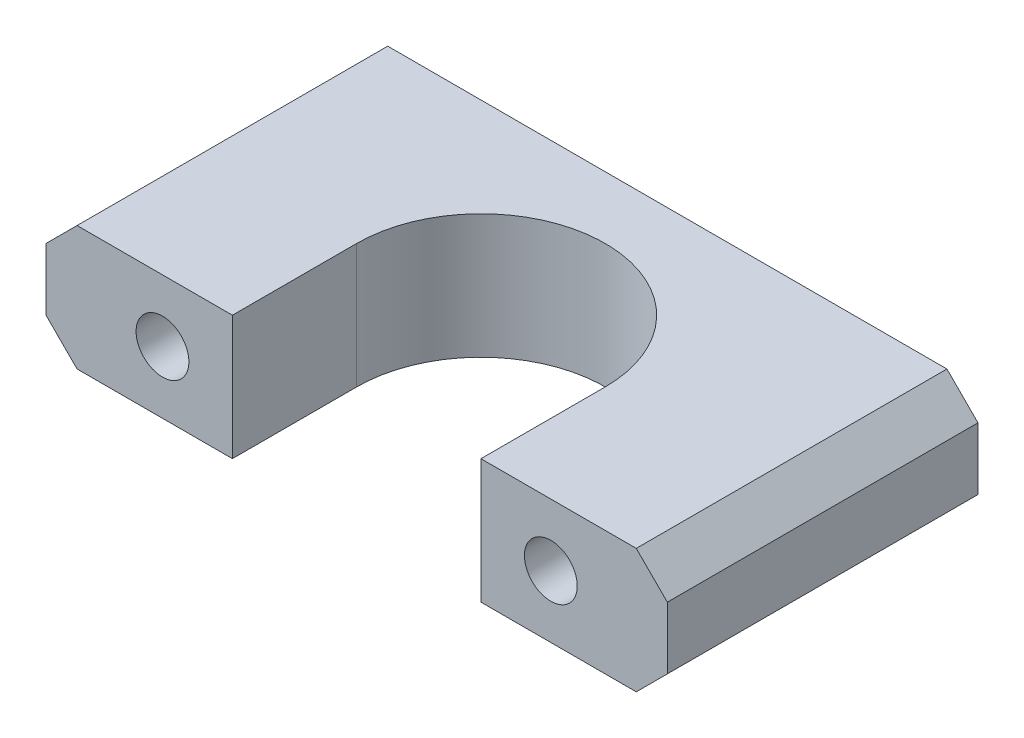
ISO-10303-21;
HEADER;
FILE_DESCRIPTION(('STEP AP214'),'2;1');
FILE_NAME('part.step','',(''),(''),'','','');
FILE_SCHEMA(('AUTOMOTIVE_DESIGN { 1 0 10303 214 1 1 1 1 }'));
ENDSEC;
DATA;
#1=APPLICATION_CONTEXT('core data for automotive mechanical design processes');
#2=APPLICATION_PROTOCOL_DEFINITION('international standard','automotive_design',2000,#1);
#3=PRODUCT_CONTEXT('',#1,'mechanical');
#4=PRODUCT('Part','Part','',(#3));
#5=PRODUCT_RELATED_PRODUCT_CATEGORY('part','',(#4));
#6=PRODUCT_DEFINITION_FORMATION('','',#4);
#7=PRODUCT_DEFINITION_CONTEXT('part definition',#1,'design');
#8=PRODUCT_DEFINITION('design','',#6,#7);
#9=PRODUCT_DEFINITION_SHAPE('','',#8);
#10=(LENGTH_UNIT() NAMED_UNIT(*) SI_UNIT(.MILLI.,.METRE.));
#11=(NAMED_UNIT(*) PLANE_ANGLE_UNIT() SI_UNIT($,.RADIAN.));
#12=(NAMED_UNIT(*) SI_UNIT($,.STERADIAN.) SOLID_ANGLE_UNIT());
#13=UNCERTAINTY_MEASURE_WITH_UNIT(LENGTH_MEASURE(1.E-05),#10,'distance_accuracy_value','');
#14=(GEOMETRIC_REPRESENTATION_CONTEXT(3) GLOBAL_UNCERTAINTY_ASSIGNED_CONTEXT((#13)) GLOBAL_UNIT_ASSIGNED_CONTEXT((#10,
#11,#12)) REPRESENTATION_CONTEXT('',''));
#15=CARTESIAN_POINT('',(0.,0.,0.));
#16=DIRECTION('',(0.,0.,1.));
#17=DIRECTION('',(1.,0.,0.));
#18=AXIS2_PLACEMENT_3D('',#15,#16,#17);
#19=CARTESIAN_POINT('',(0.,8.,0.));
#20=DIRECTION('',(0.,0.,-1.));
#21=DIRECTION('',(-1.,0.,0.));
#22=AXIS2_PLACEMENT_3D('',#19,#20,#21);
#23=PLANE('',#22);
#24=CARTESIAN_POINT('',(7.5,4.,0.));
#25=DIRECTION('',(0.,0.,1.));
#26=DIRECTION('',(1.,0.,0.));
#27=AXIS2_PLACEMENT_3D('',#24,#25,#26);
#28=CIRCLE('',#27,1.7);
#29=CARTESIAN_POINT('',(9.2,4.,0.));
#30=VERTEX_POINT('',#29);
#31=EDGE_CURVE('E150',#30,#30,#28,.T.);
#32=ORIENTED_EDGE('',*,*,#31,.F.);
#33=EDGE_LOOP('',(#32));
#34=FACE_BOUND('',#33,.T.);
#35=DIRECTION('',(1.,0.,0.));
#36=VECTOR('',#35,1.);
#37=CARTESIAN_POINT('',(0.,8.,0.));
#38=LINE('',#37,#36);
#39=CARTESIAN_POINT('',(2.,8.,0.));
#40=VERTEX_POINT('',#39);
#41=CARTESIAN_POINT('',(12.,8.,0.));
#42=VERTEX_POINT('',#41);
#43=EDGE_CURVE('E164',#40,#42,#38,.T.);
#44=ORIENTED_EDGE('',*,*,#43,.F.);
#45=DIRECTION('',(0.707106781186546,0.707106781186549,0.));
#46=VECTOR('',#45,1.);
#47=CARTESIAN_POINT('',(2.,8.,0.));
#48=LINE('',#47,#46);
#49=CARTESIAN_POINT('',(0.,5.99999999999999,0.));
#50=VERTEX_POINT('',#49);
#51=EDGE_CURVE('E54',#40,#50,#48,.F.);
#52=ORIENTED_EDGE('',*,*,#51,.T.);
#53=DIRECTION('',(0.,-1.,0.));
#54=VECTOR('',#53,1.);
#55=CARTESIAN_POINT('',(0.,8.,0.));
#56=LINE('',#55,#54);
#57=CARTESIAN_POINT('',(0.,2.,0.));
#58=VERTEX_POINT('',#57);
#59=EDGE_CURVE('E184',#50,#58,#56,.T.);
#60=ORIENTED_EDGE('',*,*,#59,.T.);
#61=DIRECTION('',(0.707106781186549,-0.707106781186546,0.));
#62=VECTOR('',#61,1.);
#63=CARTESIAN_POINT('',(0.,2.,0.));
#64=LINE('',#63,#62);
#65=CARTESIAN_POINT('',(2.00000000000001,0.,0.));
#66=VERTEX_POINT('',#65);
#67=EDGE_CURVE('E46',#58,#66,#64,.T.);
#68=ORIENTED_EDGE('',*,*,#67,.T.);
#69=DIRECTION('',(1.,0.,0.));
#70=VECTOR('',#69,1.);
#71=CARTESIAN_POINT('',(0.,0.,0.));
#72=LINE('',#71,#70);
#73=CARTESIAN_POINT('',(12.,0.,0.));
#74=VERTEX_POINT('',#73);
#75=EDGE_CURVE('E171',#66,#74,#72,.T.);
#76=ORIENTED_EDGE('',*,*,#75,.T.);
#77=DIRECTION('',(0.,-1.,0.));
#78=VECTOR('',#77,1.);
#79=CARTESIAN_POINT('',(12.,8.,0.));
#80=LINE('',#79,#78);
#81=EDGE_CURVE('E160',#42,#74,#80,.T.);
#82=ORIENTED_EDGE('',*,*,#81,.F.);
#83=EDGE_LOOP('',(#44,#52,#60,#68,#76,#82));
#84=FACE_BOUND('',#83,.T.);
#85=ADVANCED_FACE('F31',(#34,#84),#23,.F.);
#86=CARTESIAN_POINT('',(0.,8.,0.));
#87=DIRECTION('',(1.,0.,0.));
#88=DIRECTION('',(0.,0.,-1.));
#89=AXIS2_PLACEMENT_3D('',#86,#87,#88);
#90=PLANE('',#89);
#91=ORIENTED_EDGE('',*,*,#59,.F.);
#92=DIRECTION('',(0.,0.,-1.));
#93=VECTOR('',#92,1.);
#94=CARTESIAN_POINT('',(0.,5.99999999999999,0.));
#95=LINE('',#94,#93);
#96=CARTESIAN_POINT('',(0.,5.99999999999999,-20.));
#97=VERTEX_POINT('',#96);
#98=EDGE_CURVE('E11',#50,#97,#95,.T.);
#99=ORIENTED_EDGE('',*,*,#98,.T.);
#100=DIRECTION('',(0.,-1.,0.));
#101=VECTOR('',#100,1.);
#102=CARTESIAN_POINT('',(0.,8.,-20.));
#103=LINE('',#102,#101);
#104=CARTESIAN_POINT('',(0.,2.,-20.));
#105=VERTEX_POINT('',#104);
#106=EDGE_CURVE('E170',#97,#105,#103,.T.);
#107=ORIENTED_EDGE('',*,*,#106,.T.);
#108=DIRECTION('',(0.,0.,1.));
#109=VECTOR('',#108,1.);
#110=CARTESIAN_POINT('',(0.,2.,0.));
#111=LINE('',#110,#109);
#112=EDGE_CURVE('E39',#105,#58,#111,.T.);
#113=ORIENTED_EDGE('',*,*,#112,.T.);
#114=EDGE_LOOP('',(#91,#99,#107,#113));
#115=FACE_BOUND('',#114,.T.);
#116=ADVANCED_FACE('F215',(#115),#90,.F.);
#117=CARTESIAN_POINT('',(32.5,4.,0.));
#118=DIRECTION('',(0.,0.,1.));
#119=DIRECTION('',(-1.,0.,0.));
#120=AXIS2_PLACEMENT_3D('',#117,#118,#119);
#121=CIRCLE('',#120,1.7);
#122=CARTESIAN_POINT('',(30.8,4.,0.));
#123=VERTEX_POINT('',#122);
#124=EDGE_CURVE('E279',#123,#123,#121,.T.);
#125=ORIENTED_EDGE('',*,*,#124,.F.);
#126=EDGE_LOOP('',(#125));
#127=FACE_BOUND('',#126,.T.);
#128=DIRECTION('',(0.,-1.,0.));
#129=VECTOR('',#128,1.);
#130=CARTESIAN_POINT('',(40.,8.,0.));
#131=LINE('',#130,#129);
#132=CARTESIAN_POINT('',(40.,5.99999999999998,0.));
#133=VERTEX_POINT('',#132);
#134=CARTESIAN_POINT('',(40.,2.,0.));
#135=VERTEX_POINT('',#134);
#136=EDGE_CURVE('E181',#133,#135,#131,.T.);
#137=ORIENTED_EDGE('',*,*,#136,.F.);
#138=DIRECTION('',(0.707106781186546,-0.707106781186549,0.));
#139=VECTOR('',#138,1.);
#140=CARTESIAN_POINT('',(38.,8.,0.));
#141=LINE('',#140,#139);
#142=CARTESIAN_POINT('',(38.,8.,0.));
#143=VERTEX_POINT('',#142);
#144=EDGE_CURVE('E207',#133,#143,#141,.F.);
#145=ORIENTED_EDGE('',*,*,#144,.T.);
#146=CARTESIAN_POINT('',(28.,8.,0.));
#147=VERTEX_POINT('',#146);
#148=EDGE_CURVE('E167',#147,#143,#38,.T.);
#149=ORIENTED_EDGE('',*,*,#148,.F.);
#150=DIRECTION('',(0.,-1.,0.));
#151=VECTOR('',#150,1.);
#152=CARTESIAN_POINT('',(28.,8.,0.));
#153=LINE('',#152,#151);
#154=CARTESIAN_POINT('',(28.,0.,0.));
#155=VERTEX_POINT('',#154);
#156=EDGE_CURVE('E131',#147,#155,#153,.T.);
#157=ORIENTED_EDGE('',*,*,#156,.T.);
#158=CARTESIAN_POINT('',(38.,0.,0.));
#159=VERTEX_POINT('',#158);
#160=EDGE_CURVE('E159',#155,#159,#72,.T.);
#161=ORIENTED_EDGE('',*,*,#160,.T.);
#162=DIRECTION('',(0.707106781186549,0.707106781186546,0.));
#163=VECTOR('',#162,1.);
#164=CARTESIAN_POINT('',(40.,2.,0.));
#165=LINE('',#164,#163);
#166=EDGE_CURVE('E205',#159,#135,#165,.T.);
#167=ORIENTED_EDGE('',*,*,#166,.T.);
#168=EDGE_LOOP('',(#137,#145,#149,#157,#161,#167));
#169=FACE_BOUND('',#168,.T.);
#170=ADVANCED_FACE('F238',(#127,#169),#23,.F.);
#171=CARTESIAN_POINT('',(40.,8.,0.));
#172=DIRECTION('',(-1.,0.,0.));
#173=DIRECTION('',(0.,0.,1.));
#174=AXIS2_PLACEMENT_3D('',#171,#172,#173);
#175=PLANE('',#174);
#176=DIRECTION('',(0.,-1.,0.));
#177=VECTOR('',#176,1.);
#178=CARTESIAN_POINT('',(40.,8.,-20.));
#179=LINE('',#178,#177);
#180=CARTESIAN_POINT('',(40.,5.99999999999998,-20.));
#181=VERTEX_POINT('',#180);
#182=CARTESIAN_POINT('',(40.,2.,-20.));
#183=VERTEX_POINT('',#182);
#184=EDGE_CURVE('E178',#181,#183,#179,.T.);
#185=ORIENTED_EDGE('',*,*,#184,.F.);
#186=DIRECTION('',(0.,0.,1.));
#187=VECTOR('',#186,1.);
#188=CARTESIAN_POINT('',(40.,5.99999999999998,0.));
#189=LINE('',#188,#187);
#190=EDGE_CURVE('E203',#181,#133,#189,.T.);
#191=ORIENTED_EDGE('',*,*,#190,.T.);
#192=ORIENTED_EDGE('',*,*,#136,.T.);
#193=DIRECTION('',(0.,0.,-1.));
#194=VECTOR('',#193,1.);
#195=CARTESIAN_POINT('',(40.,2.,-20.));
#196=LINE('',#195,#194);
#197=EDGE_CURVE('E200',#135,#183,#196,.T.);
#198=ORIENTED_EDGE('',*,*,#197,.T.);
#199=EDGE_LOOP('',(#185,#191,#192,#198));
#200=FACE_BOUND('',#199,.T.);
#201=ADVANCED_FACE('F242',(#200),#175,.F.);
#202=CARTESIAN_POINT('',(0.,8.,-20.));
#203=DIRECTION('',(0.,0.,1.));
#204=DIRECTION('',(1.,0.,0.));
#205=AXIS2_PLACEMENT_3D('',#202,#203,#204);
#206=PLANE('',#205);
#207=CARTESIAN_POINT('',(32.5,4.,-20.));
#208=DIRECTION('',(0.,0.,1.));
#209=DIRECTION('',(-1.,0.,0.));
#210=AXIS2_PLACEMENT_3D('',#207,#208,#209);
#211=CIRCLE('',#210,1.7);
#212=CARTESIAN_POINT('',(30.8,4.,-20.));
#213=VERTEX_POINT('',#212);
#214=EDGE_CURVE('E281',#213,#213,#211,.T.);
#215=ORIENTED_EDGE('',*,*,#214,.T.);
#216=EDGE_LOOP('',(#215));
#217=FACE_BOUND('',#216,.T.);
#218=CARTESIAN_POINT('',(7.5,4.,-20.));
#219=DIRECTION('',(0.,0.,1.));
#220=DIRECTION('',(1.,0.,0.));
#221=AXIS2_PLACEMENT_3D('',#218,#219,#220);
#222=CIRCLE('',#221,1.7);
#223=CARTESIAN_POINT('',(9.2,4.,-20.));
#224=VERTEX_POINT('',#223);
#225=EDGE_CURVE('E155',#224,#224,#222,.T.);
#226=ORIENTED_EDGE('',*,*,#225,.T.);
#227=EDGE_LOOP('',(#226));
#228=FACE_BOUND('',#227,.T.);
#229=DIRECTION('',(-1.,0.,0.));
#230=VECTOR('',#229,1.);
#231=CARTESIAN_POINT('',(0.,8.,-20.));
#232=LINE('',#231,#230);
#233=CARTESIAN_POINT('',(38.,8.,-20.));
#234=VERTEX_POINT('',#233);
#235=CARTESIAN_POINT('',(2.,8.,-20.));
#236=VERTEX_POINT('',#235);
#237=EDGE_CURVE('E166',#234,#236,#232,.T.);
#238=ORIENTED_EDGE('',*,*,#237,.F.);
#239=DIRECTION('',(-0.707106781186546,0.707106781186549,0.));
#240=VECTOR('',#239,1.);
#241=CARTESIAN_POINT('',(38.,8.,-20.));
#242=LINE('',#241,#240);
#243=EDGE_CURVE('E198',#234,#181,#242,.F.);
#244=ORIENTED_EDGE('',*,*,#243,.T.);
#245=ORIENTED_EDGE('',*,*,#184,.T.);
#246=DIRECTION('',(-0.707106781186549,-0.707106781186546,0.));
#247=VECTOR('',#246,1.);
#248=CARTESIAN_POINT('',(40.,2.,-20.));
#249=LINE('',#248,#247);
#250=CARTESIAN_POINT('',(38.,0.,-20.));
#251=VERTEX_POINT('',#250);
#252=EDGE_CURVE('E196',#183,#251,#249,.T.);
#253=ORIENTED_EDGE('',*,*,#252,.T.);
#254=DIRECTION('',(-1.,0.,0.));
#255=VECTOR('',#254,1.);
#256=CARTESIAN_POINT('',(0.,0.,-20.));
#257=LINE('',#256,#255);
#258=CARTESIAN_POINT('',(2.00000000000001,0.,-20.));
#259=VERTEX_POINT('',#258);
#260=EDGE_CURVE('E173',#251,#259,#257,.T.);
#261=ORIENTED_EDGE('',*,*,#260,.T.);
#262=DIRECTION('',(-0.707106781186549,0.707106781186546,0.));
#263=VECTOR('',#262,1.);
#264=CARTESIAN_POINT('',(0.,2.,-20.));
#265=LINE('',#264,#263);
#266=EDGE_CURVE('E192',#259,#105,#265,.T.);
#267=ORIENTED_EDGE('',*,*,#266,.T.);
#268=ORIENTED_EDGE('',*,*,#106,.F.);
#269=DIRECTION('',(-0.707106781186546,-0.707106781186549,0.));
#270=VECTOR('',#269,1.);
#271=CARTESIAN_POINT('',(2.,8.,-20.));
#272=LINE('',#271,#270);
#273=EDGE_CURVE('E194',#97,#236,#272,.F.);
#274=ORIENTED_EDGE('',*,*,#273,.T.);
#275=EDGE_LOOP('',(#238,#244,#245,#253,#261,#267,#268,#274));
#276=FACE_BOUND('',#275,.T.);
#277=ADVANCED_FACE('F227',(#217,#228,#276),#206,.F.);
#278=CARTESIAN_POINT('',(0.,8.,-20.));
#279=DIRECTION('',(0.,-1.,0.));
#280=DIRECTION('',(0.,0.,-1.));
#281=AXIS2_PLACEMENT_3D('',#278,#279,#280);
#282=PLANE('',#281);
#283=ORIENTED_EDGE('',*,*,#148,.T.);
#284=DIRECTION('',(0.,0.,-1.));
#285=VECTOR('',#284,1.);
#286=CARTESIAN_POINT('',(38.,8.,-20.));
#287=LINE('',#286,#285);
#288=EDGE_CURVE('E189',#143,#234,#287,.T.);
#289=ORIENTED_EDGE('',*,*,#288,.T.);
#290=ORIENTED_EDGE('',*,*,#237,.T.);
#291=DIRECTION('',(0.,0.,1.));
#292=VECTOR('',#291,1.);
#293=CARTESIAN_POINT('',(2.,8.,-20.));
#294=LINE('',#293,#292);
#295=EDGE_CURVE('E186',#236,#40,#294,.T.);
#296=ORIENTED_EDGE('',*,*,#295,.T.);
#297=ORIENTED_EDGE('',*,*,#43,.T.);
#298=DIRECTION('',(0.,0.,-1.));
#299=VECTOR('',#298,1.);
#300=CARTESIAN_POINT('',(12.,8.,-8.));
#301=LINE('',#300,#299);
#302=CARTESIAN_POINT('',(12.,8.,-8.));
#303=VERTEX_POINT('',#302);
#304=EDGE_CURVE('E132',#42,#303,#301,.T.);
#305=ORIENTED_EDGE('',*,*,#304,.T.);
#306=CARTESIAN_POINT('',(20.,8.,-8.));
#307=DIRECTION('',(0.,-1.,0.));
#308=DIRECTION('',(0.,0.,-1.));
#309=AXIS2_PLACEMENT_3D('',#306,#307,#308);
#310=CIRCLE('',#309,8.);
#311=CARTESIAN_POINT('',(28.,8.,-8.));
#312=VERTEX_POINT('',#311);
#313=EDGE_CURVE('E125',#303,#312,#310,.T.);
#314=ORIENTED_EDGE('',*,*,#313,.T.);
#315=DIRECTION('',(0.,0.,1.));
#316=VECTOR('',#315,1.);
#317=CARTESIAN_POINT('',(28.,8.,0.));
#318=LINE('',#317,#316);
#319=EDGE_CURVE('E135',#312,#147,#318,.T.);
#320=ORIENTED_EDGE('',*,*,#319,.T.);
#321=EDGE_LOOP('',(#283,#289,#290,#296,#297,#305,#314,#320));
#322=FACE_BOUND('',#321,.T.);
#323=ADVANCED_FACE('F142',(#322),#282,.F.);
#324=CARTESIAN_POINT('',(0.,0.,-20.));
#325=DIRECTION('',(0.,-1.,0.));
#326=DIRECTION('',(0.,0.,-1.));
#327=AXIS2_PLACEMENT_3D('',#324,#325,#326);
#328=PLANE('',#327);
#329=ORIENTED_EDGE('',*,*,#260,.F.);
#330=DIRECTION('',(0.,0.,1.));
#331=VECTOR('',#330,1.);
#332=CARTESIAN_POINT('',(38.,0.,0.));
#333=LINE('',#332,#331);
#334=EDGE_CURVE('E211',#251,#159,#333,.T.);
#335=ORIENTED_EDGE('',*,*,#334,.T.);
#336=ORIENTED_EDGE('',*,*,#160,.F.);
#337=DIRECTION('',(0.,0.,1.));
#338=VECTOR('',#337,1.);
#339=CARTESIAN_POINT('',(28.,0.,0.));
#340=LINE('',#339,#338);
#341=CARTESIAN_POINT('',(28.,0.,-8.));
#342=VERTEX_POINT('',#341);
#343=EDGE_CURVE('E147',#342,#155,#340,.T.);
#344=ORIENTED_EDGE('',*,*,#343,.F.);
#345=CARTESIAN_POINT('',(20.,0.,-8.));
#346=DIRECTION('',(0.,-1.,0.));
#347=DIRECTION('',(0.,0.,-1.));
#348=AXIS2_PLACEMENT_3D('',#345,#346,#347);
#349=CIRCLE('',#348,8.);
#350=CARTESIAN_POINT('',(12.,0.,-8.));
#351=VERTEX_POINT('',#350);
#352=EDGE_CURVE('E128',#351,#342,#349,.T.);
#353=ORIENTED_EDGE('',*,*,#352,.F.);
#354=DIRECTION('',(0.,0.,-1.));
#355=VECTOR('',#354,1.);
#356=CARTESIAN_POINT('',(12.,0.,-8.));
#357=LINE('',#356,#355);
#358=EDGE_CURVE('E144',#74,#351,#357,.T.);
#359=ORIENTED_EDGE('',*,*,#358,.F.);
#360=ORIENTED_EDGE('',*,*,#75,.F.);
#361=DIRECTION('',(0.,0.,-1.));
#362=VECTOR('',#361,1.);
#363=CARTESIAN_POINT('',(2.00000000000001,0.,-20.));
#364=LINE('',#363,#362);
#365=EDGE_CURVE('E209',#66,#259,#364,.T.);
#366=ORIENTED_EDGE('',*,*,#365,.T.);
#367=EDGE_LOOP('',(#329,#335,#336,#344,#353,#359,#360,#366));
#368=FACE_BOUND('',#367,.T.);
#369=ADVANCED_FACE('F224',(#368),#328,.T.);
#370=CARTESIAN_POINT('',(20.,8.,-8.));
#371=DIRECTION('',(0.,-1.,0.));
#372=DIRECTION('',(0.,0.,-1.));
#373=AXIS2_PLACEMENT_3D('',#370,#371,#372);
#374=CYLINDRICAL_SURFACE('',#373,8.);
#375=ORIENTED_EDGE('',*,*,#352,.T.);
#376=DIRECTION('',(0.,-1.,0.));
#377=VECTOR('',#376,1.);
#378=CARTESIAN_POINT('',(28.,8.,-8.));
#379=LINE('',#378,#377);
#380=EDGE_CURVE('E121',#312,#342,#379,.T.);
#381=ORIENTED_EDGE('',*,*,#380,.F.);
#382=ORIENTED_EDGE('',*,*,#313,.F.);
#383=DIRECTION('',(0.,-1.,0.));
#384=VECTOR('',#383,1.);
#385=CARTESIAN_POINT('',(12.,8.,-8.));
#386=LINE('',#385,#384);
#387=EDGE_CURVE('E157',#303,#351,#386,.T.);
#388=ORIENTED_EDGE('',*,*,#387,.T.);
#389=EDGE_LOOP('',(#375,#381,#382,#388));
#390=FACE_BOUND('',#389,.T.);
#391=ADVANCED_FACE('F123',(#390),#374,.F.);
#392=CARTESIAN_POINT('',(12.,8.,-8.));
#393=DIRECTION('',(-1.,0.,0.));
#394=DIRECTION('',(0.,0.,1.));
#395=AXIS2_PLACEMENT_3D('',#392,#393,#394);
#396=PLANE('',#395);
#397=ORIENTED_EDGE('',*,*,#358,.T.);
#398=ORIENTED_EDGE('',*,*,#387,.F.);
#399=ORIENTED_EDGE('',*,*,#304,.F.);
#400=ORIENTED_EDGE('',*,*,#81,.T.);
#401=EDGE_LOOP('',(#397,#398,#399,#400));
#402=FACE_BOUND('',#401,.T.);
#403=ADVANCED_FACE('F251',(#402),#396,.F.);
#404=CARTESIAN_POINT('',(28.,8.,0.));
#405=DIRECTION('',(1.,0.,0.));
#406=DIRECTION('',(0.,0.,-1.));
#407=AXIS2_PLACEMENT_3D('',#404,#405,#406);
#408=PLANE('',#407);
#409=ORIENTED_EDGE('',*,*,#343,.T.);
#410=ORIENTED_EDGE('',*,*,#156,.F.);
#411=ORIENTED_EDGE('',*,*,#319,.F.);
#412=ORIENTED_EDGE('',*,*,#380,.T.);
#413=EDGE_LOOP('',(#409,#410,#411,#412));
#414=FACE_BOUND('',#413,.T.);
#415=ADVANCED_FACE('F136',(#414),#408,.F.);
#416=CARTESIAN_POINT('',(7.5,4.,-20.));
#417=DIRECTION('',(0.,0.,1.));
#418=DIRECTION('',(1.,0.,0.));
#419=AXIS2_PLACEMENT_3D('',#416,#417,#418);
#420=CYLINDRICAL_SURFACE('',#419,1.7);
#421=ORIENTED_EDGE('',*,*,#225,.F.);
#422=EDGE_LOOP('',(#421));
#423=FACE_BOUND('',#422,.T.);
#424=ORIENTED_EDGE('',*,*,#31,.T.);
#425=EDGE_LOOP('',(#424));
#426=FACE_BOUND('',#425,.T.);
#427=ADVANCED_FACE('F258',(#423,#426),#420,.F.);
#428=CARTESIAN_POINT('',(32.5,4.,-20.));
#429=DIRECTION('',(0.,0.,1.));
#430=DIRECTION('',(1.,0.,0.));
#431=AXIS2_PLACEMENT_3D('',#428,#429,#430);
#432=CYLINDRICAL_SURFACE('',#431,1.7);
#433=ORIENTED_EDGE('',*,*,#214,.F.);
#434=EDGE_LOOP('',(#433));
#435=FACE_BOUND('',#434,.T.);
#436=ORIENTED_EDGE('',*,*,#124,.T.);
#437=EDGE_LOOP('',(#436));
#438=FACE_BOUND('',#437,.T.);
#439=ADVANCED_FACE('F291',(#435,#438),#432,.F.);
#440=CARTESIAN_POINT('',(38.,8.,-20.));
#441=DIRECTION('',(-0.707106781186549,-0.707106781186546,0.));
#442=DIRECTION('',(0.707106781186546,-0.707106781186549,0.));
#443=AXIS2_PLACEMENT_3D('',#440,#441,#442);
#444=PLANE('',#443);
#445=ORIENTED_EDGE('',*,*,#144,.F.);
#446=ORIENTED_EDGE('',*,*,#190,.F.);
#447=ORIENTED_EDGE('',*,*,#243,.F.);
#448=ORIENTED_EDGE('',*,*,#288,.F.);
#449=EDGE_LOOP('',(#445,#446,#447,#448));
#450=FACE_BOUND('',#449,.T.);
#451=ADVANCED_FACE('F245',(#450),#444,.F.);
#452=CARTESIAN_POINT('',(40.,2.,0.));
#453=DIRECTION('',(0.707106781186546,-0.707106781186549,0.));
#454=DIRECTION('',(0.707106781186549,0.707106781186546,0.));
#455=AXIS2_PLACEMENT_3D('',#452,#453,#454);
#456=PLANE('',#455);
#457=ORIENTED_EDGE('',*,*,#166,.F.);
#458=ORIENTED_EDGE('',*,*,#334,.F.);
#459=ORIENTED_EDGE('',*,*,#252,.F.);
#460=ORIENTED_EDGE('',*,*,#197,.F.);
#461=EDGE_LOOP('',(#457,#458,#459,#460));
#462=FACE_BOUND('',#461,.T.);
#463=ADVANCED_FACE('F234',(#462),#456,.T.);
#464=CARTESIAN_POINT('',(2.,8.,-20.));
#465=DIRECTION('',(0.707106781186549,-0.707106781186546,0.));
#466=DIRECTION('',(0.707106781186546,0.707106781186549,0.));
#467=AXIS2_PLACEMENT_3D('',#464,#465,#466);
#468=PLANE('',#467);
#469=ORIENTED_EDGE('',*,*,#273,.F.);
#470=ORIENTED_EDGE('',*,*,#98,.F.);
#471=ORIENTED_EDGE('',*,*,#51,.F.);
#472=ORIENTED_EDGE('',*,*,#295,.F.);
#473=EDGE_LOOP('',(#469,#470,#471,#472));
#474=FACE_BOUND('',#473,.T.);
#475=ADVANCED_FACE('F249',(#474),#468,.F.);
#476=CARTESIAN_POINT('',(0.,2.,0.));
#477=DIRECTION('',(-0.707106781186546,-0.707106781186549,0.));
#478=DIRECTION('',(0.707106781186549,-0.707106781186546,0.));
#479=AXIS2_PLACEMENT_3D('',#476,#477,#478);
#480=PLANE('',#479);
#481=ORIENTED_EDGE('',*,*,#266,.F.);
#482=ORIENTED_EDGE('',*,*,#365,.F.);
#483=ORIENTED_EDGE('',*,*,#67,.F.);
#484=ORIENTED_EDGE('',*,*,#112,.F.);
#485=EDGE_LOOP('',(#481,#482,#483,#484));
#486=FACE_BOUND('',#485,.T.);
#487=ADVANCED_FACE('F33',(#486),#480,.T.);
#488=CLOSED_SHELL('',(#85,#116,#170,#201,#277,#323,#369,#391,#403,#415,#427,#439,#451,#463,#475,#487));
#489=MANIFOLD_SOLID_BREP('B2',#488);
#490=ADVANCED_BREP_SHAPE_REPRESENTATION('',(#18,#489),#14);
#491=SHAPE_DEFINITION_REPRESENTATION(#9,#490);
ENDSEC;
END-ISO-10303-21;
